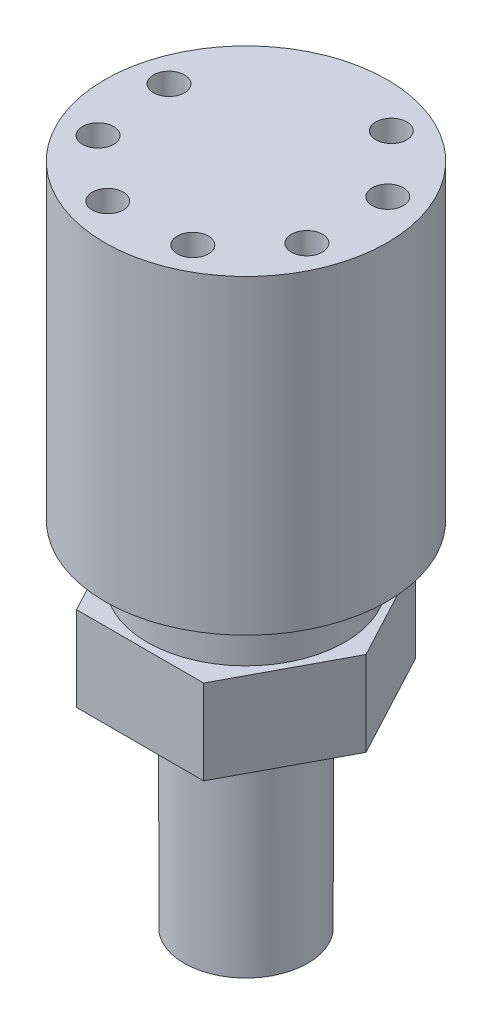
ISO-10303-21;
HEADER;
FILE_DESCRIPTION(('STEP AP214'),'2;1');
FILE_NAME('part.step','',(''),(''),'','','');
FILE_SCHEMA(('AUTOMOTIVE_DESIGN { 1 0 10303 214 1 1 1 1 }'));
ENDSEC;
DATA;
#1=APPLICATION_CONTEXT('core data for automotive mechanical design processes');
#2=APPLICATION_PROTOCOL_DEFINITION('international standard','automotive_design',2000,#1);
#3=PRODUCT_CONTEXT('',#1,'mechanical');
#4=PRODUCT('Part','Part','',(#3));
#5=PRODUCT_RELATED_PRODUCT_CATEGORY('part','',(#4));
#6=PRODUCT_DEFINITION_FORMATION('','',#4);
#7=PRODUCT_DEFINITION_CONTEXT('part definition',#1,'design');
#8=PRODUCT_DEFINITION('design','',#6,#7);
#9=PRODUCT_DEFINITION_SHAPE('','',#8);
#10=(LENGTH_UNIT() NAMED_UNIT(*) SI_UNIT(.MILLI.,.METRE.));
#11=(NAMED_UNIT(*) PLANE_ANGLE_UNIT() SI_UNIT($,.RADIAN.));
#12=(NAMED_UNIT(*) SI_UNIT($,.STERADIAN.) SOLID_ANGLE_UNIT());
#13=UNCERTAINTY_MEASURE_WITH_UNIT(LENGTH_MEASURE(1.E-05),#10,'distance_accuracy_value','');
#14=(GEOMETRIC_REPRESENTATION_CONTEXT(3) GLOBAL_UNCERTAINTY_ASSIGNED_CONTEXT((#13)) GLOBAL_UNIT_ASSIGNED_CONTEXT((#10,
#11,#12)) REPRESENTATION_CONTEXT('',''));
#15=CARTESIAN_POINT('',(0.,0.,0.));
#16=DIRECTION('',(0.,0.,1.));
#17=DIRECTION('',(1.,0.,0.));
#18=AXIS2_PLACEMENT_3D('',#15,#16,#17);
#19=CARTESIAN_POINT('',(0.,-7.62,0.));
#20=DIRECTION('',(0.,1.,0.));
#21=DIRECTION('',(0.,0.,1.));
#22=AXIS2_PLACEMENT_3D('',#19,#20,#21);
#23=PLANE('',#22);
#24=DIRECTION('',(1.,0.,0.));
#25=VECTOR('',#24,1.);
#26=CARTESIAN_POINT('',(-5.715,-7.62,9.525));
#27=LINE('',#26,#25);
#28=CARTESIAN_POINT('',(-5.715,-7.62,9.525));
#29=VERTEX_POINT('',#28);
#30=CARTESIAN_POINT('',(5.715,-7.62,9.525));
#31=VERTEX_POINT('',#30);
#32=EDGE_CURVE('E138',#29,#31,#27,.T.);
#33=ORIENTED_EDGE('',*,*,#32,.F.);
#34=DIRECTION('',(0.470588235294117,0.,0.882352941176471));
#35=VECTOR('',#34,1.);
#36=CARTESIAN_POINT('',(-10.795,-7.62,0.));
#37=LINE('',#36,#35);
#38=CARTESIAN_POINT('',(-10.795,-7.62,0.));
#39=VERTEX_POINT('',#38);
#40=EDGE_CURVE('E112',#39,#29,#37,.T.);
#41=ORIENTED_EDGE('',*,*,#40,.F.);
#42=DIRECTION('',(-0.470588235294117,0.,0.882352941176471));
#43=VECTOR('',#42,1.);
#44=CARTESIAN_POINT('',(-5.715,-7.62,-9.525));
#45=LINE('',#44,#43);
#46=CARTESIAN_POINT('',(-5.715,-7.62,-9.525));
#47=VERTEX_POINT('',#46);
#48=EDGE_CURVE('E97',#47,#39,#45,.T.);
#49=ORIENTED_EDGE('',*,*,#48,.F.);
#50=DIRECTION('',(-1.,0.,0.));
#51=VECTOR('',#50,1.);
#52=CARTESIAN_POINT('',(5.71500000000001,-7.62,-9.525));
#53=LINE('',#52,#51);
#54=CARTESIAN_POINT('',(5.71500000000001,-7.62,-9.525));
#55=VERTEX_POINT('',#54);
#56=EDGE_CURVE('E110',#55,#47,#53,.T.);
#57=ORIENTED_EDGE('',*,*,#56,.F.);
#58=DIRECTION('',(-0.470588235294117,0.,-0.882352941176471));
#59=VECTOR('',#58,1.);
#60=CARTESIAN_POINT('',(10.795,-7.62,0.));
#61=LINE('',#60,#59);
#62=CARTESIAN_POINT('',(10.795,-7.62,0.));
#63=VERTEX_POINT('',#62);
#64=EDGE_CURVE('E115',#63,#55,#61,.T.);
#65=ORIENTED_EDGE('',*,*,#64,.F.);
#66=DIRECTION('',(0.470588235294118,0.,-0.882352941176471));
#67=VECTOR('',#66,1.);
#68=CARTESIAN_POINT('',(5.715,-7.62,9.525));
#69=LINE('',#68,#67);
#70=EDGE_CURVE('E117',#31,#63,#69,.T.);
#71=ORIENTED_EDGE('',*,*,#70,.F.);
#72=EDGE_LOOP('',(#33,#41,#49,#57,#65,#71));
#73=FACE_BOUND('',#72,.T.);
#74=CARTESIAN_POINT('',(0.,-7.62,0.));
#75=DIRECTION('',(0.,1.,0.));
#76=DIRECTION('',(0.,0.,1.));
#77=AXIS2_PLACEMENT_3D('',#74,#75,#76);
#78=CIRCLE('',#77,5.55625);
#79=CARTESIAN_POINT('',(0.,-7.62,5.55625));
#80=VERTEX_POINT('',#79);
#81=EDGE_CURVE('E11',#80,#80,#78,.F.);
#82=ORIENTED_EDGE('',*,*,#81,.F.);
#83=EDGE_LOOP('',(#82));
#84=FACE_BOUND('',#83,.T.);
#85=ADVANCED_FACE('F34',(#73,#84),#23,.F.);
#86=CARTESIAN_POINT('',(0.,5.08,0.));
#87=DIRECTION('',(0.,-1.,0.));
#88=DIRECTION('',(0.,0.,-1.));
#89=AXIS2_PLACEMENT_3D('',#86,#87,#88);
#90=CYLINDRICAL_SURFACE('',#89,8.89);
#91=CARTESIAN_POINT('',(0.,5.08,0.));
#92=DIRECTION('',(0.,1.,0.));
#93=DIRECTION('',(0.,0.,1.));
#94=AXIS2_PLACEMENT_3D('',#91,#92,#93);
#95=CIRCLE('',#94,8.89);
#96=CARTESIAN_POINT('',(0.,5.08,8.89));
#97=VERTEX_POINT('',#96);
#98=EDGE_CURVE('E43',#97,#97,#95,.T.);
#99=ORIENTED_EDGE('',*,*,#98,.F.);
#100=EDGE_LOOP('',(#99));
#101=FACE_BOUND('',#100,.T.);
#102=CARTESIAN_POINT('',(0.,0.,0.));
#103=DIRECTION('',(0.,1.,0.));
#104=DIRECTION('',(0.,0.,1.));
#105=AXIS2_PLACEMENT_3D('',#102,#103,#104);
#106=CIRCLE('',#105,8.89);
#107=CARTESIAN_POINT('',(0.,0.,8.89));
#108=VERTEX_POINT('',#107);
#109=EDGE_CURVE('E140',#108,#108,#106,.T.);
#110=ORIENTED_EDGE('',*,*,#109,.T.);
#111=EDGE_LOOP('',(#110));
#112=FACE_BOUND('',#111,.T.);
#113=ADVANCED_FACE('F36',(#101,#112),#90,.T.);
#114=CARTESIAN_POINT('',(0.,0.,0.));
#115=DIRECTION('',(0.,1.,0.));
#116=DIRECTION('',(0.,0.,1.));
#117=AXIS2_PLACEMENT_3D('',#114,#115,#116);
#118=PLANE('',#117);
#119=DIRECTION('',(1.,0.,0.));
#120=VECTOR('',#119,1.);
#121=CARTESIAN_POINT('',(-5.715,0.,9.525));
#122=LINE('',#121,#120);
#123=CARTESIAN_POINT('',(-5.715,0.,9.525));
#124=VERTEX_POINT('',#123);
#125=CARTESIAN_POINT('',(5.715,0.,9.525));
#126=VERTEX_POINT('',#125);
#127=EDGE_CURVE('E122',#124,#126,#122,.T.);
#128=ORIENTED_EDGE('',*,*,#127,.T.);
#129=DIRECTION('',(0.470588235294118,0.,-0.882352941176471));
#130=VECTOR('',#129,1.);
#131=CARTESIAN_POINT('',(5.715,0.,9.525));
#132=LINE('',#131,#130);
#133=CARTESIAN_POINT('',(10.795,0.,0.));
#134=VERTEX_POINT('',#133);
#135=EDGE_CURVE('E125',#126,#134,#132,.T.);
#136=ORIENTED_EDGE('',*,*,#135,.T.);
#137=DIRECTION('',(-0.470588235294117,0.,-0.882352941176471));
#138=VECTOR('',#137,1.);
#139=CARTESIAN_POINT('',(10.795,0.,0.));
#140=LINE('',#139,#138);
#141=CARTESIAN_POINT('',(5.71500000000001,0.,-9.525));
#142=VERTEX_POINT('',#141);
#143=EDGE_CURVE('E129',#134,#142,#140,.T.);
#144=ORIENTED_EDGE('',*,*,#143,.T.);
#145=DIRECTION('',(-1.,0.,0.));
#146=VECTOR('',#145,1.);
#147=CARTESIAN_POINT('',(5.71500000000001,0.,-9.525));
#148=LINE('',#147,#146);
#149=CARTESIAN_POINT('',(-5.715,0.,-9.525));
#150=VERTEX_POINT('',#149);
#151=EDGE_CURVE('E132',#142,#150,#148,.T.);
#152=ORIENTED_EDGE('',*,*,#151,.T.);
#153=DIRECTION('',(-0.470588235294117,0.,0.882352941176471));
#154=VECTOR('',#153,1.);
#155=CARTESIAN_POINT('',(-5.715,0.,-9.525));
#156=LINE('',#155,#154);
#157=CARTESIAN_POINT('',(-10.795,0.,0.));
#158=VERTEX_POINT('',#157);
#159=EDGE_CURVE('E99',#150,#158,#156,.T.);
#160=ORIENTED_EDGE('',*,*,#159,.T.);
#161=DIRECTION('',(0.470588235294117,0.,0.882352941176471));
#162=VECTOR('',#161,1.);
#163=CARTESIAN_POINT('',(-10.795,0.,0.));
#164=LINE('',#163,#162);
#165=EDGE_CURVE('E135',#158,#124,#164,.T.);
#166=ORIENTED_EDGE('',*,*,#165,.T.);
#167=EDGE_LOOP('',(#128,#136,#144,#152,#160,#166));
#168=FACE_BOUND('',#167,.T.);
#169=ORIENTED_EDGE('',*,*,#109,.F.);
#170=EDGE_LOOP('',(#169));
#171=FACE_BOUND('',#170,.T.);
#172=ADVANCED_FACE('F154',(#168,#171),#118,.T.);
#173=CARTESIAN_POINT('',(-5.715,-7.62,9.525));
#174=DIRECTION('',(0.,0.,1.));
#175=DIRECTION('',(1.,0.,0.));
#176=AXIS2_PLACEMENT_3D('',#173,#174,#175);
#177=PLANE('',#176);
#178=ORIENTED_EDGE('',*,*,#127,.F.);
#179=DIRECTION('',(0.,1.,0.));
#180=VECTOR('',#179,1.);
#181=CARTESIAN_POINT('',(-5.715,-7.62,9.525));
#182=LINE('',#181,#180);
#183=EDGE_CURVE('E51',#29,#124,#182,.T.);
#184=ORIENTED_EDGE('',*,*,#183,.F.);
#185=ORIENTED_EDGE('',*,*,#32,.T.);
#186=DIRECTION('',(0.,1.,0.));
#187=VECTOR('',#186,1.);
#188=CARTESIAN_POINT('',(5.715,-7.62,9.525));
#189=LINE('',#188,#187);
#190=EDGE_CURVE('E86',#31,#126,#189,.T.);
#191=ORIENTED_EDGE('',*,*,#190,.T.);
#192=EDGE_LOOP('',(#178,#184,#185,#191));
#193=FACE_BOUND('',#192,.T.);
#194=ADVANCED_FACE('F158',(#193),#177,.T.);
#195=CARTESIAN_POINT('',(-10.795,-7.62,0.));
#196=DIRECTION('',(-0.882352941176471,0.,0.470588235294117));
#197=DIRECTION('',(0.470588235294117,0.,0.882352941176471));
#198=AXIS2_PLACEMENT_3D('',#195,#196,#197);
#199=PLANE('',#198);
#200=ORIENTED_EDGE('',*,*,#165,.F.);
#201=DIRECTION('',(0.,1.,0.));
#202=VECTOR('',#201,1.);
#203=CARTESIAN_POINT('',(-10.795,-7.62,0.));
#204=LINE('',#203,#202);
#205=EDGE_CURVE('E74',#39,#158,#204,.T.);
#206=ORIENTED_EDGE('',*,*,#205,.F.);
#207=ORIENTED_EDGE('',*,*,#40,.T.);
#208=ORIENTED_EDGE('',*,*,#183,.T.);
#209=EDGE_LOOP('',(#200,#206,#207,#208));
#210=FACE_BOUND('',#209,.T.);
#211=ADVANCED_FACE('F164',(#210),#199,.T.);
#212=CARTESIAN_POINT('',(-5.715,-7.62,-9.525));
#213=DIRECTION('',(-0.882352941176471,0.,-0.470588235294117));
#214=DIRECTION('',(-0.470588235294117,0.,0.882352941176471));
#215=AXIS2_PLACEMENT_3D('',#212,#213,#214);
#216=PLANE('',#215);
#217=ORIENTED_EDGE('',*,*,#159,.F.);
#218=DIRECTION('',(0.,1.,0.));
#219=VECTOR('',#218,1.);
#220=CARTESIAN_POINT('',(-5.715,-7.62,-9.525));
#221=LINE('',#220,#219);
#222=EDGE_CURVE('E94',#47,#150,#221,.T.);
#223=ORIENTED_EDGE('',*,*,#222,.F.);
#224=ORIENTED_EDGE('',*,*,#48,.T.);
#225=ORIENTED_EDGE('',*,*,#205,.T.);
#226=EDGE_LOOP('',(#217,#223,#224,#225));
#227=FACE_BOUND('',#226,.T.);
#228=ADVANCED_FACE('F96',(#227),#216,.T.);
#229=CARTESIAN_POINT('',(5.71500000000001,-7.62,-9.525));
#230=DIRECTION('',(0.,0.,-1.));
#231=DIRECTION('',(-1.,0.,0.));
#232=AXIS2_PLACEMENT_3D('',#229,#230,#231);
#233=PLANE('',#232);
#234=ORIENTED_EDGE('',*,*,#151,.F.);
#235=DIRECTION('',(0.,1.,0.));
#236=VECTOR('',#235,1.);
#237=CARTESIAN_POINT('',(5.71500000000001,-7.62,-9.525));
#238=LINE('',#237,#236);
#239=EDGE_CURVE('E104',#55,#142,#238,.T.);
#240=ORIENTED_EDGE('',*,*,#239,.F.);
#241=ORIENTED_EDGE('',*,*,#56,.T.);
#242=ORIENTED_EDGE('',*,*,#222,.T.);
#243=EDGE_LOOP('',(#234,#240,#241,#242));
#244=FACE_BOUND('',#243,.T.);
#245=ADVANCED_FACE('F114',(#244),#233,.T.);
#246=CARTESIAN_POINT('',(10.795,-7.62,0.));
#247=DIRECTION('',(0.882352941176471,0.,-0.470588235294117));
#248=DIRECTION('',(-0.470588235294117,0.,-0.882352941176471));
#249=AXIS2_PLACEMENT_3D('',#246,#247,#248);
#250=PLANE('',#249);
#251=ORIENTED_EDGE('',*,*,#143,.F.);
#252=DIRECTION('',(0.,1.,0.));
#253=VECTOR('',#252,1.);
#254=CARTESIAN_POINT('',(10.795,-7.62,0.));
#255=LINE('',#254,#253);
#256=EDGE_CURVE('E143',#63,#134,#255,.T.);
#257=ORIENTED_EDGE('',*,*,#256,.F.);
#258=ORIENTED_EDGE('',*,*,#64,.T.);
#259=ORIENTED_EDGE('',*,*,#239,.T.);
#260=EDGE_LOOP('',(#251,#257,#258,#259));
#261=FACE_BOUND('',#260,.T.);
#262=ADVANCED_FACE('F309',(#261),#250,.T.);
#263=CARTESIAN_POINT('',(5.715,-7.62,9.525));
#264=DIRECTION('',(0.88235294117647,0.,0.470588235294118));
#265=DIRECTION('',(0.470588235294118,0.,-0.882352941176471));
#266=AXIS2_PLACEMENT_3D('',#263,#264,#265);
#267=PLANE('',#266);
#268=ORIENTED_EDGE('',*,*,#135,.F.);
#269=ORIENTED_EDGE('',*,*,#190,.F.);
#270=ORIENTED_EDGE('',*,*,#70,.T.);
#271=ORIENTED_EDGE('',*,*,#256,.T.);
#272=EDGE_LOOP('',(#268,#269,#270,#271));
#273=FACE_BOUND('',#272,.T.);
#274=ADVANCED_FACE('F175',(#273),#267,.T.);
#275=CARTESIAN_POINT('',(0.,-26.67,0.));
#276=DIRECTION('',(0.,1.,0.));
#277=DIRECTION('',(0.,0.,1.));
#278=AXIS2_PLACEMENT_3D('',#275,#276,#277);
#279=CYLINDRICAL_SURFACE('',#278,5.55625);
#280=CARTESIAN_POINT('',(0.,-26.67,0.));
#281=DIRECTION('',(0.,-1.,0.));
#282=DIRECTION('',(0.,0.,-1.));
#283=AXIS2_PLACEMENT_3D('',#280,#281,#282);
#284=CIRCLE('',#283,5.55625);
#285=CARTESIAN_POINT('',(0.,-26.67,-5.55625));
#286=VERTEX_POINT('',#285);
#287=EDGE_CURVE('E126',#286,#286,#284,.T.);
#288=ORIENTED_EDGE('',*,*,#287,.F.);
#289=EDGE_LOOP('',(#288));
#290=FACE_BOUND('',#289,.T.);
#291=ORIENTED_EDGE('',*,*,#81,.T.);
#292=EDGE_LOOP('',(#291));
#293=FACE_BOUND('',#292,.T.);
#294=ADVANCED_FACE('F171',(#290,#293),#279,.T.);
#295=CARTESIAN_POINT('',(0.,-26.67,0.));
#296=DIRECTION('',(0.,-1.,0.));
#297=DIRECTION('',(0.,0.,-1.));
#298=AXIS2_PLACEMENT_3D('',#295,#296,#297);
#299=PLANE('',#298);
#300=ORIENTED_EDGE('',*,*,#287,.T.);
#301=EDGE_LOOP('',(#300));
#302=FACE_BOUND('',#301,.T.);
#303=ADVANCED_FACE('F174',(#302),#299,.T.);
#304=CARTESIAN_POINT('',(0.,5.08,0.));
#305=DIRECTION('',(0.,1.,0.));
#306=DIRECTION('',(0.,0.,1.));
#307=AXIS2_PLACEMENT_3D('',#304,#305,#306);
#308=PLANE('',#307);
#309=CARTESIAN_POINT('',(0.,5.08,0.));
#310=DIRECTION('',(0.,1.,0.));
#311=DIRECTION('',(0.,0.,1.));
#312=AXIS2_PLACEMENT_3D('',#309,#310,#311);
#313=CIRCLE('',#312,12.7);
#314=CARTESIAN_POINT('',(0.,5.08,12.7));
#315=VERTEX_POINT('',#314);
#316=EDGE_CURVE('E290',#315,#315,#313,.T.);
#317=ORIENTED_EDGE('',*,*,#316,.F.);
#318=EDGE_LOOP('',(#317));
#319=FACE_BOUND('',#318,.T.);
#320=ORIENTED_EDGE('',*,*,#98,.T.);
#321=EDGE_LOOP('',(#320));
#322=FACE_BOUND('',#321,.T.);
#323=ADVANCED_FACE('F150',(#319,#322),#308,.F.);
#324=CARTESIAN_POINT('',(0.,33.02,0.));
#325=DIRECTION('',(0.,-1.,0.));
#326=DIRECTION('',(0.,0.,-1.));
#327=AXIS2_PLACEMENT_3D('',#324,#325,#326);
#328=CYLINDRICAL_SURFACE('',#327,12.7);
#329=CARTESIAN_POINT('',(0.,33.02,0.));
#330=DIRECTION('',(0.,1.,0.));
#331=DIRECTION('',(0.,0.,1.));
#332=AXIS2_PLACEMENT_3D('',#329,#330,#331);
#333=CIRCLE('',#332,12.7);
#334=CARTESIAN_POINT('',(0.,33.02,12.7));
#335=VERTEX_POINT('',#334);
#336=EDGE_CURVE('E293',#335,#335,#333,.T.);
#337=ORIENTED_EDGE('',*,*,#336,.F.);
#338=EDGE_LOOP('',(#337));
#339=FACE_BOUND('',#338,.T.);
#340=ORIENTED_EDGE('',*,*,#316,.T.);
#341=EDGE_LOOP('',(#340));
#342=FACE_BOUND('',#341,.T.);
#343=ADVANCED_FACE('F180',(#339,#342),#328,.T.);
#344=CARTESIAN_POINT('',(0.,33.02,0.));
#345=DIRECTION('',(0.,1.,0.));
#346=DIRECTION('',(0.,0.,1.));
#347=AXIS2_PLACEMENT_3D('',#344,#345,#346);
#348=PLANE('',#347);
#349=CARTESIAN_POINT('',(-9.48668210351071,33.02,-2.56287347659986));
#350=DIRECTION('',(0.,1.,0.));
#351=DIRECTION('',(0.,0.,1.));
#352=AXIS2_PLACEMENT_3D('',#349,#350,#351);
#353=CIRCLE('',#352,1.397);
#354=CARTESIAN_POINT('',(-9.48668210351071,33.02,-1.16587347659987));
#355=VERTEX_POINT('',#354);
#356=EDGE_CURVE('E252',#355,#355,#353,.T.);
#357=ORIENTED_EDGE('',*,*,#356,.F.);
#358=EDGE_LOOP('',(#357));
#359=FACE_BOUND('',#358,.T.);
#360=CARTESIAN_POINT('',(-8.65911300030867,33.02,4.64598965108779));
#361=DIRECTION('',(0.,1.,0.));
#362=DIRECTION('',(0.,0.,1.));
#363=AXIS2_PLACEMENT_3D('',#360,#361,#362);
#364=CIRCLE('',#363,1.397);
#365=CARTESIAN_POINT('',(-8.65911300030867,33.02,6.04298965108779));
#366=VERTEX_POINT('',#365);
#367=EDGE_CURVE('E251',#366,#366,#364,.T.);
#368=ORIENTED_EDGE('',*,*,#367,.F.);
#369=EDGE_LOOP('',(#368));
#370=FACE_BOUND('',#369,.T.);
#371=CARTESIAN_POINT('',(-3.11013900814336,33.02,9.32161429904469));
#372=DIRECTION('',(0.,1.,0.));
#373=DIRECTION('',(0.,0.,1.));
#374=AXIS2_PLACEMENT_3D('',#371,#372,#373);
#375=CIRCLE('',#374,1.397);
#376=CARTESIAN_POINT('',(-3.11013900814336,33.02,10.7186142990447));
#377=VERTEX_POINT('',#376);
#378=EDGE_CURVE('E261',#377,#377,#375,.T.);
#379=ORIENTED_EDGE('',*,*,#378,.F.);
#380=EDGE_LOOP('',(#379));
#381=FACE_BOUND('',#380,.T.);
#382=CARTESIAN_POINT('',(4.13464672800542,33.02,8.91460342498327));
#383=DIRECTION('',(0.,1.,0.));
#384=DIRECTION('',(0.,0.,1.));
#385=AXIS2_PLACEMENT_3D('',#382,#383,#384);
#386=CIRCLE('',#385,1.397);
#387=CARTESIAN_POINT('',(4.13464672800542,33.02,10.3116034249833));
#388=VERTEX_POINT('',#387);
#389=EDGE_CURVE('E266',#388,#388,#386,.T.);
#390=ORIENTED_EDGE('',*,*,#389,.F.);
#391=EDGE_LOOP('',(#390));
#392=FACE_BOUND('',#391,.T.);
#393=CARTESIAN_POINT('',(9.12500510247815,33.02,3.6468808137746));
#394=DIRECTION('',(0.,1.,0.));
#395=DIRECTION('',(0.,0.,1.));
#396=AXIS2_PLACEMENT_3D('',#393,#394,#395);
#397=CIRCLE('',#396,1.397);
#398=CARTESIAN_POINT('',(9.12500510247815,33.02,5.0438808137746));
#399=VERTEX_POINT('',#398);
#400=EDGE_CURVE('E272',#399,#399,#397,.T.);
#401=ORIENTED_EDGE('',*,*,#400,.F.);
#402=EDGE_LOOP('',(#401));
#403=FACE_BOUND('',#402,.T.);
#404=CARTESIAN_POINT('',(9.13992965351891,33.02,-3.60931346918705));
#405=DIRECTION('',(0.,1.,0.));
#406=DIRECTION('',(0.,0.,1.));
#407=AXIS2_PLACEMENT_3D('',#404,#405,#406);
#408=CIRCLE('',#407,1.397);
#409=CARTESIAN_POINT('',(9.13992965351891,33.02,-2.21231346918705));
#410=VERTEX_POINT('',#409);
#411=EDGE_CURVE('E278',#410,#410,#408,.T.);
#412=ORIENTED_EDGE('',*,*,#411,.F.);
#413=EDGE_LOOP('',(#412));
#414=FACE_BOUND('',#413,.T.);
#415=CARTESIAN_POINT('',(4.17128272912493,33.02,-8.89751977709707));
#416=DIRECTION('',(0.,1.,0.));
#417=DIRECTION('',(0.,0.,1.));
#418=AXIS2_PLACEMENT_3D('',#415,#416,#417);
#419=CIRCLE('',#418,1.397);
#420=CARTESIAN_POINT('',(4.17128272912493,33.02,-7.50051977709707));
#421=VERTEX_POINT('',#420);
#422=EDGE_CURVE('E284',#421,#421,#419,.T.);
#423=ORIENTED_EDGE('',*,*,#422,.F.);
#424=EDGE_LOOP('',(#423));
#425=FACE_BOUND('',#424,.T.);
#426=ORIENTED_EDGE('',*,*,#336,.T.);
#427=EDGE_LOOP('',(#426));
#428=FACE_BOUND('',#427,.T.);
#429=ADVANCED_FACE('F183',(#359,#370,#381,#392,#403,#414,#425,#428),#348,.T.);
#430=CARTESIAN_POINT('',(4.17128272912493,12.7,-8.89751977709707));
#431=DIRECTION('',(0.,1.,0.));
#432=DIRECTION('',(0.,0.,1.));
#433=AXIS2_PLACEMENT_3D('',#430,#431,#432);
#434=CYLINDRICAL_SURFACE('',#433,1.397);
#435=CARTESIAN_POINT('',(4.17128272912493,12.7,-8.89751977709707));
#436=DIRECTION('',(0.,1.,0.));
#437=DIRECTION('',(0.,0.,1.));
#438=AXIS2_PLACEMENT_3D('',#435,#436,#437);
#439=CIRCLE('',#438,1.397);
#440=CARTESIAN_POINT('',(4.17128272912493,12.7,-7.50051977709707));
#441=VERTEX_POINT('',#440);
#442=EDGE_CURVE('E287',#441,#441,#439,.T.);
#443=ORIENTED_EDGE('',*,*,#442,.F.);
#444=EDGE_LOOP('',(#443));
#445=FACE_BOUND('',#444,.T.);
#446=ORIENTED_EDGE('',*,*,#422,.T.);
#447=EDGE_LOOP('',(#446));
#448=FACE_BOUND('',#447,.T.);
#449=ADVANCED_FACE('F190',(#445,#448),#434,.F.);
#450=CARTESIAN_POINT('',(4.17128272912493,12.7,-8.89751977709707));
#451=DIRECTION('',(0.,1.,0.));
#452=DIRECTION('',(0.,0.,1.));
#453=AXIS2_PLACEMENT_3D('',#450,#451,#452);
#454=PLANE('',#453);
#455=ORIENTED_EDGE('',*,*,#442,.T.);
#456=EDGE_LOOP('',(#455));
#457=FACE_BOUND('',#456,.T.);
#458=ADVANCED_FACE('F194',(#457),#454,.T.);
#459=CARTESIAN_POINT('',(9.13992965351891,12.7,-3.60931346918705));
#460=DIRECTION('',(0.,1.,0.));
#461=DIRECTION('',(0.,0.,1.));
#462=AXIS2_PLACEMENT_3D('',#459,#460,#461);
#463=CYLINDRICAL_SURFACE('',#462,1.397);
#464=CARTESIAN_POINT('',(9.13992965351891,12.7,-3.60931346918705));
#465=DIRECTION('',(0.,1.,0.));
#466=DIRECTION('',(0.,0.,1.));
#467=AXIS2_PLACEMENT_3D('',#464,#465,#466);
#468=CIRCLE('',#467,1.397);
#469=CARTESIAN_POINT('',(9.13992965351891,12.7,-2.21231346918705));
#470=VERTEX_POINT('',#469);
#471=EDGE_CURVE('E281',#470,#470,#468,.T.);
#472=ORIENTED_EDGE('',*,*,#471,.F.);
#473=EDGE_LOOP('',(#472));
#474=FACE_BOUND('',#473,.T.);
#475=ORIENTED_EDGE('',*,*,#411,.T.);
#476=EDGE_LOOP('',(#475));
#477=FACE_BOUND('',#476,.T.);
#478=ADVANCED_FACE('F198',(#474,#477),#463,.F.);
#479=CARTESIAN_POINT('',(9.13992965351891,12.7,-3.60931346918705));
#480=DIRECTION('',(0.,1.,0.));
#481=DIRECTION('',(0.,0.,1.));
#482=AXIS2_PLACEMENT_3D('',#479,#480,#481);
#483=PLANE('',#482);
#484=ORIENTED_EDGE('',*,*,#471,.T.);
#485=EDGE_LOOP('',(#484));
#486=FACE_BOUND('',#485,.T.);
#487=ADVANCED_FACE('F202',(#486),#483,.T.);
#488=CARTESIAN_POINT('',(9.12500510247815,12.7,3.6468808137746));
#489=DIRECTION('',(0.,1.,0.));
#490=DIRECTION('',(0.,0.,1.));
#491=AXIS2_PLACEMENT_3D('',#488,#489,#490);
#492=CYLINDRICAL_SURFACE('',#491,1.397);
#493=CARTESIAN_POINT('',(9.12500510247815,12.7,3.6468808137746));
#494=DIRECTION('',(0.,1.,0.));
#495=DIRECTION('',(0.,0.,1.));
#496=AXIS2_PLACEMENT_3D('',#493,#494,#495);
#497=CIRCLE('',#496,1.397);
#498=CARTESIAN_POINT('',(9.12500510247815,12.7,5.0438808137746));
#499=VERTEX_POINT('',#498);
#500=EDGE_CURVE('E275',#499,#499,#497,.T.);
#501=ORIENTED_EDGE('',*,*,#500,.F.);
#502=EDGE_LOOP('',(#501));
#503=FACE_BOUND('',#502,.T.);
#504=ORIENTED_EDGE('',*,*,#400,.T.);
#505=EDGE_LOOP('',(#504));
#506=FACE_BOUND('',#505,.T.);
#507=ADVANCED_FACE('F206',(#503,#506),#492,.F.);
#508=CARTESIAN_POINT('',(9.12500510247815,12.7,3.6468808137746));
#509=DIRECTION('',(0.,1.,0.));
#510=DIRECTION('',(0.,0.,1.));
#511=AXIS2_PLACEMENT_3D('',#508,#509,#510);
#512=PLANE('',#511);
#513=ORIENTED_EDGE('',*,*,#500,.T.);
#514=EDGE_LOOP('',(#513));
#515=FACE_BOUND('',#514,.T.);
#516=ADVANCED_FACE('F210',(#515),#512,.T.);
#517=CARTESIAN_POINT('',(4.13464672800542,12.7,8.91460342498327));
#518=DIRECTION('',(0.,1.,0.));
#519=DIRECTION('',(0.,0.,1.));
#520=AXIS2_PLACEMENT_3D('',#517,#518,#519);
#521=CYLINDRICAL_SURFACE('',#520,1.397);
#522=CARTESIAN_POINT('',(4.13464672800542,12.7,8.91460342498327));
#523=DIRECTION('',(0.,1.,0.));
#524=DIRECTION('',(0.,0.,1.));
#525=AXIS2_PLACEMENT_3D('',#522,#523,#524);
#526=CIRCLE('',#525,1.397);
#527=CARTESIAN_POINT('',(4.13464672800542,12.7,10.3116034249833));
#528=VERTEX_POINT('',#527);
#529=EDGE_CURVE('E269',#528,#528,#526,.T.);
#530=ORIENTED_EDGE('',*,*,#529,.F.);
#531=EDGE_LOOP('',(#530));
#532=FACE_BOUND('',#531,.T.);
#533=ORIENTED_EDGE('',*,*,#389,.T.);
#534=EDGE_LOOP('',(#533));
#535=FACE_BOUND('',#534,.T.);
#536=ADVANCED_FACE('F214',(#532,#535),#521,.F.);
#537=CARTESIAN_POINT('',(4.13464672800542,12.7,8.91460342498327));
#538=DIRECTION('',(0.,1.,0.));
#539=DIRECTION('',(0.,0.,1.));
#540=AXIS2_PLACEMENT_3D('',#537,#538,#539);
#541=PLANE('',#540);
#542=ORIENTED_EDGE('',*,*,#529,.T.);
#543=EDGE_LOOP('',(#542));
#544=FACE_BOUND('',#543,.T.);
#545=ADVANCED_FACE('F218',(#544),#541,.T.);
#546=CARTESIAN_POINT('',(-3.11013900814336,12.7,9.32161429904469));
#547=DIRECTION('',(0.,1.,0.));
#548=DIRECTION('',(0.,0.,1.));
#549=AXIS2_PLACEMENT_3D('',#546,#547,#548);
#550=CYLINDRICAL_SURFACE('',#549,1.397);
#551=CARTESIAN_POINT('',(-3.11013900814336,12.7,9.32161429904469));
#552=DIRECTION('',(0.,1.,0.));
#553=DIRECTION('',(0.,0.,1.));
#554=AXIS2_PLACEMENT_3D('',#551,#552,#553);
#555=CIRCLE('',#554,1.397);
#556=CARTESIAN_POINT('',(-3.11013900814336,12.7,10.7186142990447));
#557=VERTEX_POINT('',#556);
#558=EDGE_CURVE('E263',#557,#557,#555,.T.);
#559=ORIENTED_EDGE('',*,*,#558,.F.);
#560=EDGE_LOOP('',(#559));
#561=FACE_BOUND('',#560,.T.);
#562=ORIENTED_EDGE('',*,*,#378,.T.);
#563=EDGE_LOOP('',(#562));
#564=FACE_BOUND('',#563,.T.);
#565=ADVANCED_FACE('F222',(#561,#564),#550,.F.);
#566=CARTESIAN_POINT('',(-3.11013900814336,12.7,9.32161429904469));
#567=DIRECTION('',(0.,1.,0.));
#568=DIRECTION('',(0.,0.,1.));
#569=AXIS2_PLACEMENT_3D('',#566,#567,#568);
#570=PLANE('',#569);
#571=ORIENTED_EDGE('',*,*,#558,.T.);
#572=EDGE_LOOP('',(#571));
#573=FACE_BOUND('',#572,.T.);
#574=ADVANCED_FACE('F226',(#573),#570,.T.);
#575=CARTESIAN_POINT('',(-8.65911300030867,12.7,4.64598965108779));
#576=DIRECTION('',(0.,1.,0.));
#577=DIRECTION('',(0.,0.,1.));
#578=AXIS2_PLACEMENT_3D('',#575,#576,#577);
#579=CYLINDRICAL_SURFACE('',#578,1.397);
#580=CARTESIAN_POINT('',(-8.65911300030867,12.7,4.64598965108779));
#581=DIRECTION('',(0.,1.,0.));
#582=DIRECTION('',(0.,0.,1.));
#583=AXIS2_PLACEMENT_3D('',#580,#581,#582);
#584=CIRCLE('',#583,1.397);
#585=CARTESIAN_POINT('',(-8.65911300030867,12.7,6.04298965108779));
#586=VERTEX_POINT('',#585);
#587=EDGE_CURVE('E255',#586,#586,#584,.T.);
#588=ORIENTED_EDGE('',*,*,#587,.F.);
#589=EDGE_LOOP('',(#588));
#590=FACE_BOUND('',#589,.T.);
#591=ORIENTED_EDGE('',*,*,#367,.T.);
#592=EDGE_LOOP('',(#591));
#593=FACE_BOUND('',#592,.T.);
#594=ADVANCED_FACE('F230',(#590,#593),#579,.F.);
#595=CARTESIAN_POINT('',(-8.65911300030867,12.7,4.64598965108779));
#596=DIRECTION('',(0.,1.,0.));
#597=DIRECTION('',(0.,0.,1.));
#598=AXIS2_PLACEMENT_3D('',#595,#596,#597);
#599=PLANE('',#598);
#600=ORIENTED_EDGE('',*,*,#587,.T.);
#601=EDGE_LOOP('',(#600));
#602=FACE_BOUND('',#601,.T.);
#603=ADVANCED_FACE('F234',(#602),#599,.T.);
#604=CARTESIAN_POINT('',(-9.48668210351071,12.7,-2.56287347659986));
#605=DIRECTION('',(0.,1.,0.));
#606=DIRECTION('',(0.,0.,1.));
#607=AXIS2_PLACEMENT_3D('',#604,#605,#606);
#608=CYLINDRICAL_SURFACE('',#607,1.397);
#609=CARTESIAN_POINT('',(-9.48668210351071,12.7,-2.56287347659986));
#610=DIRECTION('',(0.,1.,0.));
#611=DIRECTION('',(0.,0.,1.));
#612=AXIS2_PLACEMENT_3D('',#609,#610,#611);
#613=CIRCLE('',#612,1.397);
#614=CARTESIAN_POINT('',(-9.48668210351071,12.7,-1.16587347659987));
#615=VERTEX_POINT('',#614);
#616=EDGE_CURVE('E250',#615,#615,#613,.T.);
#617=ORIENTED_EDGE('',*,*,#616,.F.);
#618=EDGE_LOOP('',(#617));
#619=FACE_BOUND('',#618,.T.);
#620=ORIENTED_EDGE('',*,*,#356,.T.);
#621=EDGE_LOOP('',(#620));
#622=FACE_BOUND('',#621,.T.);
#623=ADVANCED_FACE('F238',(#619,#622),#608,.F.);
#624=CARTESIAN_POINT('',(-9.48668210351071,12.7,-2.56287347659986));
#625=DIRECTION('',(0.,1.,0.));
#626=DIRECTION('',(0.,0.,1.));
#627=AXIS2_PLACEMENT_3D('',#624,#625,#626);
#628=PLANE('',#627);
#629=ORIENTED_EDGE('',*,*,#616,.T.);
#630=EDGE_LOOP('',(#629));
#631=FACE_BOUND('',#630,.T.);
#632=ADVANCED_FACE('F242',(#631),#628,.T.);
#633=CLOSED_SHELL('',(#85,#113,#172,#194,#211,#228,#245,#262,#274,#294,#303,#323,#343,#429,#449,
#458,#478,#487,#507,#516,#536,#545,#565,#574,#594,#603,#623,#632));
#634=MANIFOLD_SOLID_BREP('B2',#633);
#635=ADVANCED_BREP_SHAPE_REPRESENTATION('',(#18,#634),#14);
#636=SHAPE_DEFINITION_REPRESENTATION(#9,#635);
ENDSEC;
END-ISO-10303-21;
